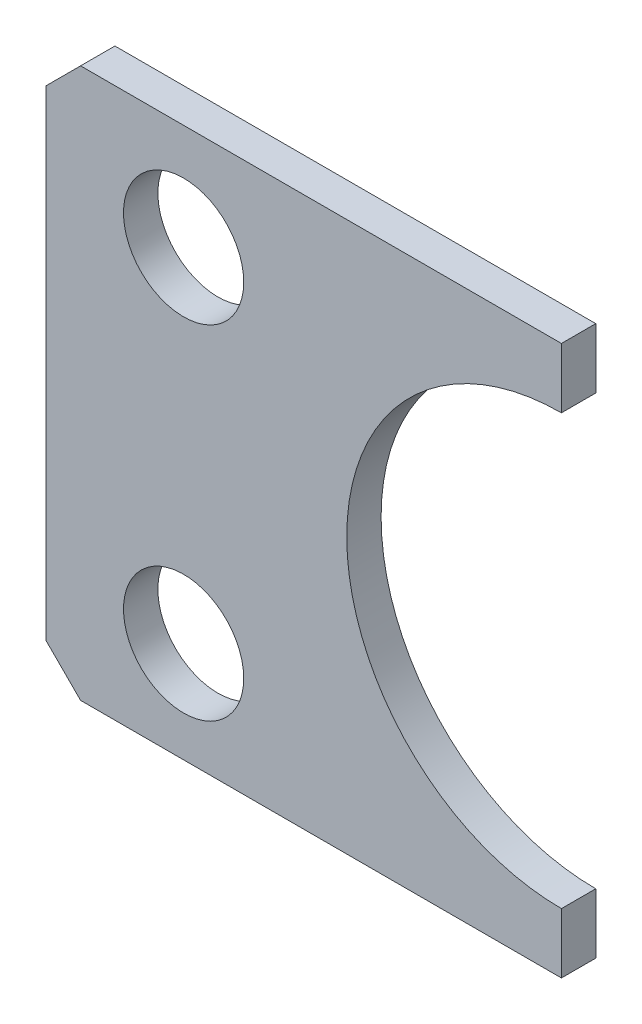
ISO-10303-21;
HEADER;
FILE_DESCRIPTION(('STEP AP214'),'2;1');
FILE_NAME('part.step','',(''),(''),'','','');
FILE_SCHEMA(('AUTOMOTIVE_DESIGN { 1 0 10303 214 1 1 1 1 }'));
ENDSEC;
DATA;
#1=APPLICATION_CONTEXT('core data for automotive mechanical design processes');
#2=APPLICATION_PROTOCOL_DEFINITION('international standard','automotive_design',2000,#1);
#3=PRODUCT_CONTEXT('',#1,'mechanical');
#4=PRODUCT('Part','Part','',(#3));
#5=PRODUCT_RELATED_PRODUCT_CATEGORY('part','',(#4));
#6=PRODUCT_DEFINITION_FORMATION('','',#4);
#7=PRODUCT_DEFINITION_CONTEXT('part definition',#1,'design');
#8=PRODUCT_DEFINITION('design','',#6,#7);
#9=PRODUCT_DEFINITION_SHAPE('','',#8);
#10=(LENGTH_UNIT() NAMED_UNIT(*) SI_UNIT(.MILLI.,.METRE.));
#11=(NAMED_UNIT(*) PLANE_ANGLE_UNIT() SI_UNIT($,.RADIAN.));
#12=(NAMED_UNIT(*) SI_UNIT($,.STERADIAN.) SOLID_ANGLE_UNIT());
#13=UNCERTAINTY_MEASURE_WITH_UNIT(LENGTH_MEASURE(1.E-05),#10,'distance_accuracy_value','');
#14=(GEOMETRIC_REPRESENTATION_CONTEXT(3) GLOBAL_UNCERTAINTY_ASSIGNED_CONTEXT((#13)) GLOBAL_UNIT_ASSIGNED_CONTEXT((#10,
#11,#12)) REPRESENTATION_CONTEXT('',''));
#15=CARTESIAN_POINT('',(0.,0.,0.));
#16=DIRECTION('',(0.,0.,1.));
#17=DIRECTION('',(1.,0.,0.));
#18=AXIS2_PLACEMENT_3D('',#15,#16,#17);
#19=CARTESIAN_POINT('',(7.5,0.,1.));
#20=DIRECTION('',(0.,0.,1.));
#21=DIRECTION('',(1.,0.,0.));
#22=AXIS2_PLACEMENT_3D('',#19,#20,#21);
#23=PLANE('',#22);
#24=CARTESIAN_POINT('',(-3.5,-5.06997767084196,1.));
#25=DIRECTION('',(0.,0.,1.));
#26=DIRECTION('',(1.,0.,0.));
#27=AXIS2_PLACEMENT_3D('',#24,#25,#26);
#28=CIRCLE('',#27,1.75);
#29=CARTESIAN_POINT('',(-1.75,-5.06997767084196,1.));
#30=VERTEX_POINT('',#29);
#31=EDGE_CURVE('E176',#30,#30,#28,.T.);
#32=ORIENTED_EDGE('',*,*,#31,.F.);
#33=EDGE_LOOP('',(#32));
#34=FACE_BOUND('',#33,.T.);
#35=DIRECTION('',(0.,-1.,0.));
#36=VECTOR('',#35,1.);
#37=CARTESIAN_POINT('',(-7.5,8.,1.));
#38=LINE('',#37,#36);
#39=CARTESIAN_POINT('',(-7.5,7.,1.));
#40=VERTEX_POINT('',#39);
#41=CARTESIAN_POINT('',(-7.5,-6.99999999999999,1.));
#42=VERTEX_POINT('',#41);
#43=EDGE_CURVE('E141',#40,#42,#38,.T.);
#44=ORIENTED_EDGE('',*,*,#43,.T.);
#45=DIRECTION('',(-0.707106781186547,0.707106781186548,0.));
#46=VECTOR('',#45,1.);
#47=CARTESIAN_POINT('',(-3.50000000000001,-11.,1.));
#48=LINE('',#47,#46);
#49=CARTESIAN_POINT('',(-6.49999999999999,-8.,1.));
#50=VERTEX_POINT('',#49);
#51=EDGE_CURVE('E41',#42,#50,#48,.F.);
#52=ORIENTED_EDGE('',*,*,#51,.T.);
#53=DIRECTION('',(1.,0.,0.));
#54=VECTOR('',#53,1.);
#55=CARTESIAN_POINT('',(-7.5,-8.,1.));
#56=LINE('',#55,#54);
#57=CARTESIAN_POINT('',(7.5,-8.,1.));
#58=VERTEX_POINT('',#57);
#59=EDGE_CURVE('E99',#50,#58,#56,.T.);
#60=ORIENTED_EDGE('',*,*,#59,.T.);
#61=DIRECTION('',(0.,1.,0.));
#62=VECTOR('',#61,1.);
#63=CARTESIAN_POINT('',(7.5,-6.25,1.));
#64=LINE('',#63,#62);
#65=CARTESIAN_POINT('',(7.5,-6.25,1.));
#66=VERTEX_POINT('',#65);
#67=EDGE_CURVE('E102',#58,#66,#64,.T.);
#68=ORIENTED_EDGE('',*,*,#67,.T.);
#69=CARTESIAN_POINT('',(7.5,0.,1.));
#70=DIRECTION('',(0.,0.,-1.));
#71=DIRECTION('',(1.,0.,0.));
#72=AXIS2_PLACEMENT_3D('',#69,#70,#71);
#73=CIRCLE('',#72,6.25);
#74=CARTESIAN_POINT('',(7.5,6.25,1.));
#75=VERTEX_POINT('',#74);
#76=EDGE_CURVE('E118',#66,#75,#73,.T.);
#77=ORIENTED_EDGE('',*,*,#76,.T.);
#78=DIRECTION('',(0.,1.,0.));
#79=VECTOR('',#78,1.);
#80=CARTESIAN_POINT('',(7.5,8.,1.));
#81=LINE('',#80,#79);
#82=CARTESIAN_POINT('',(7.5,8.,1.));
#83=VERTEX_POINT('',#82);
#84=EDGE_CURVE('E170',#75,#83,#81,.T.);
#85=ORIENTED_EDGE('',*,*,#84,.T.);
#86=DIRECTION('',(-1.,0.,0.));
#87=VECTOR('',#86,1.);
#88=CARTESIAN_POINT('',(-7.5,8.,1.));
#89=LINE('',#88,#87);
#90=CARTESIAN_POINT('',(-6.5,8.,1.));
#91=VERTEX_POINT('',#90);
#92=EDGE_CURVE('E142',#83,#91,#89,.T.);
#93=ORIENTED_EDGE('',*,*,#92,.T.);
#94=DIRECTION('',(0.707106781186548,0.707106781186547,0.));
#95=VECTOR('',#94,1.);
#96=CARTESIAN_POINT('',(-3.49999999999999,11.,1.));
#97=LINE('',#96,#95);
#98=EDGE_CURVE('E139',#91,#40,#97,.F.);
#99=ORIENTED_EDGE('',*,*,#98,.T.);
#100=EDGE_LOOP('',(#44,#52,#60,#68,#77,#85,#93,#99));
#101=FACE_BOUND('',#100,.T.);
#102=CARTESIAN_POINT('',(-3.5,4.92014780532512,1.));
#103=DIRECTION('',(0.,0.,1.));
#104=DIRECTION('',(1.,0.,0.));
#105=AXIS2_PLACEMENT_3D('',#102,#103,#104);
#106=CIRCLE('',#105,1.75);
#107=CARTESIAN_POINT('',(-1.75,4.92014780532512,1.));
#108=VERTEX_POINT('',#107);
#109=EDGE_CURVE('E184',#108,#108,#106,.T.);
#110=ORIENTED_EDGE('',*,*,#109,.F.);
#111=EDGE_LOOP('',(#110));
#112=FACE_BOUND('',#111,.T.);
#113=ADVANCED_FACE('F33',(#34,#101,#112),#23,.T.);
#114=CARTESIAN_POINT('',(7.5,0.,0.));
#115=DIRECTION('',(0.,0.,1.));
#116=DIRECTION('',(1.,0.,0.));
#117=AXIS2_PLACEMENT_3D('',#114,#115,#116);
#118=PLANE('',#117);
#119=DIRECTION('',(1.,0.,0.));
#120=VECTOR('',#119,1.);
#121=CARTESIAN_POINT('',(-7.5,-8.,0.));
#122=LINE('',#121,#120);
#123=CARTESIAN_POINT('',(-6.49999999999999,-8.,0.));
#124=VERTEX_POINT('',#123);
#125=CARTESIAN_POINT('',(7.5,-8.,0.));
#126=VERTEX_POINT('',#125);
#127=EDGE_CURVE('E122',#124,#126,#122,.T.);
#128=ORIENTED_EDGE('',*,*,#127,.F.);
#129=DIRECTION('',(0.707106781186547,-0.707106781186548,0.));
#130=VECTOR('',#129,1.);
#131=CARTESIAN_POINT('',(-6.49999999999999,-8.,0.));
#132=LINE('',#131,#130);
#133=CARTESIAN_POINT('',(-7.5,-6.99999999999999,0.));
#134=VERTEX_POINT('',#133);
#135=EDGE_CURVE('E133',#124,#134,#132,.F.);
#136=ORIENTED_EDGE('',*,*,#135,.T.);
#137=DIRECTION('',(0.,-1.,0.));
#138=VECTOR('',#137,1.);
#139=CARTESIAN_POINT('',(-7.5,8.,0.));
#140=LINE('',#139,#138);
#141=CARTESIAN_POINT('',(-7.5,7.,0.));
#142=VERTEX_POINT('',#141);
#143=EDGE_CURVE('E109',#142,#134,#140,.T.);
#144=ORIENTED_EDGE('',*,*,#143,.F.);
#145=DIRECTION('',(-0.707106781186548,-0.707106781186547,0.));
#146=VECTOR('',#145,1.);
#147=CARTESIAN_POINT('',(-7.5,7.,0.));
#148=LINE('',#147,#146);
#149=CARTESIAN_POINT('',(-6.5,8.,0.));
#150=VERTEX_POINT('',#149);
#151=EDGE_CURVE('E126',#142,#150,#148,.F.);
#152=ORIENTED_EDGE('',*,*,#151,.T.);
#153=DIRECTION('',(-1.,0.,0.));
#154=VECTOR('',#153,1.);
#155=CARTESIAN_POINT('',(-7.5,8.,0.));
#156=LINE('',#155,#154);
#157=CARTESIAN_POINT('',(7.5,8.,0.));
#158=VERTEX_POINT('',#157);
#159=EDGE_CURVE('E154',#158,#150,#156,.T.);
#160=ORIENTED_EDGE('',*,*,#159,.F.);
#161=DIRECTION('',(0.,1.,0.));
#162=VECTOR('',#161,1.);
#163=CARTESIAN_POINT('',(7.5,8.,0.));
#164=LINE('',#163,#162);
#165=CARTESIAN_POINT('',(7.5,6.25,0.));
#166=VERTEX_POINT('',#165);
#167=EDGE_CURVE('E158',#166,#158,#164,.T.);
#168=ORIENTED_EDGE('',*,*,#167,.F.);
#169=CARTESIAN_POINT('',(7.5,0.,0.));
#170=DIRECTION('',(0.,0.,-1.));
#171=DIRECTION('',(1.,0.,0.));
#172=AXIS2_PLACEMENT_3D('',#169,#170,#171);
#173=CIRCLE('',#172,6.25);
#174=CARTESIAN_POINT('',(7.5,-6.25,0.));
#175=VERTEX_POINT('',#174);
#176=EDGE_CURVE('E161',#175,#166,#173,.T.);
#177=ORIENTED_EDGE('',*,*,#176,.F.);
#178=DIRECTION('',(0.,1.,0.));
#179=VECTOR('',#178,1.);
#180=CARTESIAN_POINT('',(7.5,-6.25,0.));
#181=LINE('',#180,#179);
#182=EDGE_CURVE('E173',#126,#175,#181,.T.);
#183=ORIENTED_EDGE('',*,*,#182,.F.);
#184=EDGE_LOOP('',(#128,#136,#144,#152,#160,#168,#177,#183));
#185=FACE_BOUND('',#184,.T.);
#186=CARTESIAN_POINT('',(-3.5,-5.06997767084196,0.));
#187=DIRECTION('',(0.,0.,1.));
#188=DIRECTION('',(1.,0.,0.));
#189=AXIS2_PLACEMENT_3D('',#186,#187,#188);
#190=CIRCLE('',#189,1.75);
#191=CARTESIAN_POINT('',(-1.75,-5.06997767084196,0.));
#192=VERTEX_POINT('',#191);
#193=EDGE_CURVE('E181',#192,#192,#190,.T.);
#194=ORIENTED_EDGE('',*,*,#193,.T.);
#195=EDGE_LOOP('',(#194));
#196=FACE_BOUND('',#195,.T.);
#197=CARTESIAN_POINT('',(-3.5,4.92014780532512,0.));
#198=DIRECTION('',(0.,0.,1.));
#199=DIRECTION('',(1.,0.,0.));
#200=AXIS2_PLACEMENT_3D('',#197,#198,#199);
#201=CIRCLE('',#200,1.75);
#202=CARTESIAN_POINT('',(-1.75,4.92014780532512,0.));
#203=VERTEX_POINT('',#202);
#204=EDGE_CURVE('E187',#203,#203,#201,.T.);
#205=ORIENTED_EDGE('',*,*,#204,.T.);
#206=EDGE_LOOP('',(#205));
#207=FACE_BOUND('',#206,.T.);
#208=ADVANCED_FACE('F151',(#185,#196,#207),#118,.F.);
#209=CARTESIAN_POINT('',(-7.5,-8.,1.));
#210=DIRECTION('',(0.,1.,0.));
#211=DIRECTION('',(0.,0.,1.));
#212=AXIS2_PLACEMENT_3D('',#209,#210,#211);
#213=PLANE('',#212);
#214=ORIENTED_EDGE('',*,*,#59,.F.);
#215=DIRECTION('',(0.,0.,-1.));
#216=VECTOR('',#215,1.);
#217=CARTESIAN_POINT('',(-6.49999999999999,-8.,1.));
#218=LINE('',#217,#216);
#219=EDGE_CURVE('E124',#50,#124,#218,.T.);
#220=ORIENTED_EDGE('',*,*,#219,.T.);
#221=ORIENTED_EDGE('',*,*,#127,.T.);
#222=DIRECTION('',(0.,0.,-1.));
#223=VECTOR('',#222,1.);
#224=CARTESIAN_POINT('',(7.5,-8.,1.));
#225=LINE('',#224,#223);
#226=EDGE_CURVE('E114',#58,#126,#225,.T.);
#227=ORIENTED_EDGE('',*,*,#226,.F.);
#228=EDGE_LOOP('',(#214,#220,#221,#227));
#229=FACE_BOUND('',#228,.T.);
#230=ADVANCED_FACE('F120',(#229),#213,.F.);
#231=CARTESIAN_POINT('',(7.5,-6.25,1.));
#232=DIRECTION('',(-1.,0.,0.));
#233=DIRECTION('',(0.,-1.,0.));
#234=AXIS2_PLACEMENT_3D('',#231,#232,#233);
#235=PLANE('',#234);
#236=ORIENTED_EDGE('',*,*,#182,.T.);
#237=DIRECTION('',(0.,0.,-1.));
#238=VECTOR('',#237,1.);
#239=CARTESIAN_POINT('',(7.5,-6.25,1.));
#240=LINE('',#239,#238);
#241=EDGE_CURVE('E116',#66,#175,#240,.T.);
#242=ORIENTED_EDGE('',*,*,#241,.F.);
#243=ORIENTED_EDGE('',*,*,#67,.F.);
#244=ORIENTED_EDGE('',*,*,#226,.T.);
#245=EDGE_LOOP('',(#236,#242,#243,#244));
#246=FACE_BOUND('',#245,.T.);
#247=ADVANCED_FACE('F113',(#246),#235,.F.);
#248=CARTESIAN_POINT('',(7.5,0.,1.));
#249=DIRECTION('',(0.,0.,-1.));
#250=DIRECTION('',(-1.,0.,0.));
#251=AXIS2_PLACEMENT_3D('',#248,#249,#250);
#252=CYLINDRICAL_SURFACE('',#251,6.25);
#253=ORIENTED_EDGE('',*,*,#176,.T.);
#254=DIRECTION('',(0.,0.,-1.));
#255=VECTOR('',#254,1.);
#256=CARTESIAN_POINT('',(7.5,6.25,1.));
#257=LINE('',#256,#255);
#258=EDGE_CURVE('E128',#75,#166,#257,.T.);
#259=ORIENTED_EDGE('',*,*,#258,.F.);
#260=ORIENTED_EDGE('',*,*,#76,.F.);
#261=ORIENTED_EDGE('',*,*,#241,.T.);
#262=EDGE_LOOP('',(#253,#259,#260,#261));
#263=FACE_BOUND('',#262,.T.);
#264=ADVANCED_FACE('F213',(#263),#252,.F.);
#265=CARTESIAN_POINT('',(7.5,8.,1.));
#266=DIRECTION('',(-1.,0.,0.));
#267=DIRECTION('',(0.,-1.,0.));
#268=AXIS2_PLACEMENT_3D('',#265,#266,#267);
#269=PLANE('',#268);
#270=ORIENTED_EDGE('',*,*,#167,.T.);
#271=DIRECTION('',(0.,0.,-1.));
#272=VECTOR('',#271,1.);
#273=CARTESIAN_POINT('',(7.5,8.,1.));
#274=LINE('',#273,#272);
#275=EDGE_CURVE('E147',#83,#158,#274,.T.);
#276=ORIENTED_EDGE('',*,*,#275,.F.);
#277=ORIENTED_EDGE('',*,*,#84,.F.);
#278=ORIENTED_EDGE('',*,*,#258,.T.);
#279=EDGE_LOOP('',(#270,#276,#277,#278));
#280=FACE_BOUND('',#279,.T.);
#281=ADVANCED_FACE('F169',(#280),#269,.F.);
#282=CARTESIAN_POINT('',(-7.5,8.,1.));
#283=DIRECTION('',(0.,-1.,0.));
#284=DIRECTION('',(0.,0.,-1.));
#285=AXIS2_PLACEMENT_3D('',#282,#283,#284);
#286=PLANE('',#285);
#287=ORIENTED_EDGE('',*,*,#159,.T.);
#288=DIRECTION('',(0.,0.,1.));
#289=VECTOR('',#288,1.);
#290=CARTESIAN_POINT('',(-6.5,8.,1.));
#291=LINE('',#290,#289);
#292=EDGE_CURVE('E11',#150,#91,#291,.T.);
#293=ORIENTED_EDGE('',*,*,#292,.T.);
#294=ORIENTED_EDGE('',*,*,#92,.F.);
#295=ORIENTED_EDGE('',*,*,#275,.T.);
#296=EDGE_LOOP('',(#287,#293,#294,#295));
#297=FACE_BOUND('',#296,.T.);
#298=ADVANCED_FACE('F156',(#297),#286,.F.);
#299=CARTESIAN_POINT('',(-7.5,8.,1.));
#300=DIRECTION('',(1.,0.,0.));
#301=DIRECTION('',(0.,1.,0.));
#302=AXIS2_PLACEMENT_3D('',#299,#300,#301);
#303=PLANE('',#302);
#304=ORIENTED_EDGE('',*,*,#143,.T.);
#305=DIRECTION('',(0.,0.,1.));
#306=VECTOR('',#305,1.);
#307=CARTESIAN_POINT('',(-7.5,-6.99999999999999,1.));
#308=LINE('',#307,#306);
#309=EDGE_CURVE('E54',#134,#42,#308,.T.);
#310=ORIENTED_EDGE('',*,*,#309,.T.);
#311=ORIENTED_EDGE('',*,*,#43,.F.);
#312=DIRECTION('',(0.,0.,-1.));
#313=VECTOR('',#312,1.);
#314=CARTESIAN_POINT('',(-7.5,7.,1.));
#315=LINE('',#314,#313);
#316=EDGE_CURVE('E135',#40,#142,#315,.T.);
#317=ORIENTED_EDGE('',*,*,#316,.T.);
#318=EDGE_LOOP('',(#304,#310,#311,#317));
#319=FACE_BOUND('',#318,.T.);
#320=ADVANCED_FACE('F145',(#319),#303,.F.);
#321=CARTESIAN_POINT('',(-3.5,-5.06997767084196,1.));
#322=DIRECTION('',(0.,0.,-1.));
#323=DIRECTION('',(-1.,0.,0.));
#324=AXIS2_PLACEMENT_3D('',#321,#322,#323);
#325=CYLINDRICAL_SURFACE('',#324,1.75);
#326=ORIENTED_EDGE('',*,*,#31,.T.);
#327=EDGE_LOOP('',(#326));
#328=FACE_BOUND('',#327,.T.);
#329=ORIENTED_EDGE('',*,*,#193,.F.);
#330=EDGE_LOOP('',(#329));
#331=FACE_BOUND('',#330,.T.);
#332=ADVANCED_FACE('F204',(#328,#331),#325,.F.);
#333=CARTESIAN_POINT('',(-3.5,4.92014780532512,1.));
#334=DIRECTION('',(0.,0.,-1.));
#335=DIRECTION('',(-1.,0.,0.));
#336=AXIS2_PLACEMENT_3D('',#333,#334,#335);
#337=CYLINDRICAL_SURFACE('',#336,1.75);
#338=ORIENTED_EDGE('',*,*,#109,.T.);
#339=EDGE_LOOP('',(#338));
#340=FACE_BOUND('',#339,.T.);
#341=ORIENTED_EDGE('',*,*,#204,.F.);
#342=EDGE_LOOP('',(#341));
#343=FACE_BOUND('',#342,.T.);
#344=ADVANCED_FACE('F193',(#340,#343),#337,.F.);
#345=CARTESIAN_POINT('',(-6.49999999999999,-8.,1.));
#346=DIRECTION('',(0.707106781186548,0.707106781186547,0.));
#347=DIRECTION('',(0.,0.,-1.));
#348=AXIS2_PLACEMENT_3D('',#345,#346,#347);
#349=PLANE('',#348);
#350=ORIENTED_EDGE('',*,*,#51,.F.);
#351=ORIENTED_EDGE('',*,*,#309,.F.);
#352=ORIENTED_EDGE('',*,*,#135,.F.);
#353=ORIENTED_EDGE('',*,*,#219,.F.);
#354=EDGE_LOOP('',(#350,#351,#352,#353));
#355=FACE_BOUND('',#354,.T.);
#356=ADVANCED_FACE('F219',(#355),#349,.F.);
#357=CARTESIAN_POINT('',(-7.5,7.,1.));
#358=DIRECTION('',(0.707106781186547,-0.707106781186548,0.));
#359=DIRECTION('',(0.,0.,-1.));
#360=AXIS2_PLACEMENT_3D('',#357,#358,#359);
#361=PLANE('',#360);
#362=ORIENTED_EDGE('',*,*,#98,.F.);
#363=ORIENTED_EDGE('',*,*,#292,.F.);
#364=ORIENTED_EDGE('',*,*,#151,.F.);
#365=ORIENTED_EDGE('',*,*,#316,.F.);
#366=EDGE_LOOP('',(#362,#363,#364,#365));
#367=FACE_BOUND('',#366,.T.);
#368=ADVANCED_FACE('F35',(#367),#361,.F.);
#369=CLOSED_SHELL('',(#113,#208,#230,#247,#264,#281,#298,#320,#332,#344,#356,#368));
#370=MANIFOLD_SOLID_BREP('B2',#369);
#371=ADVANCED_BREP_SHAPE_REPRESENTATION('',(#18,#370),#14);
#372=SHAPE_DEFINITION_REPRESENTATION(#9,#371);
ENDSEC;
END-ISO-10303-21;
